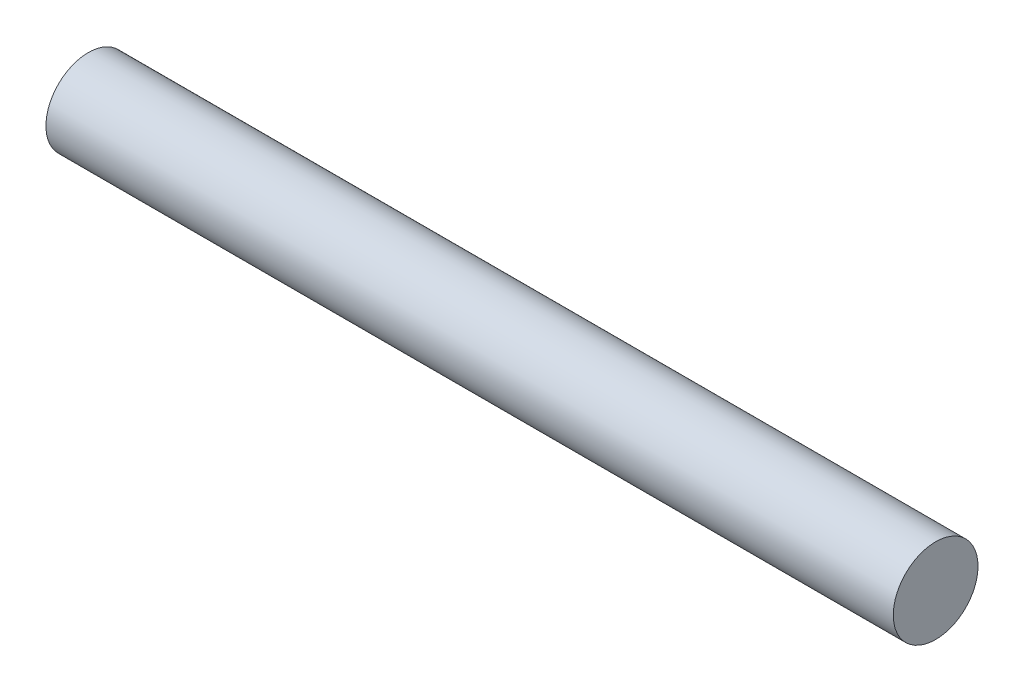
ISO-10303-21;
HEADER;
FILE_DESCRIPTION(('STEP AP214'),'2;1');
FILE_NAME('part.step','',(''),(''),'','','');
FILE_SCHEMA(('AUTOMOTIVE_DESIGN { 1 0 10303 214 1 1 1 1 }'));
ENDSEC;
DATA;
#1=APPLICATION_CONTEXT('core data for automotive mechanical design processes');
#2=APPLICATION_PROTOCOL_DEFINITION('international standard','automotive_design',2000,#1);
#3=PRODUCT_CONTEXT('',#1,'mechanical');
#4=PRODUCT('Part','Part','',(#3));
#5=PRODUCT_RELATED_PRODUCT_CATEGORY('part','',(#4));
#6=PRODUCT_DEFINITION_FORMATION('','',#4);
#7=PRODUCT_DEFINITION_CONTEXT('part definition',#1,'design');
#8=PRODUCT_DEFINITION('design','',#6,#7);
#9=PRODUCT_DEFINITION_SHAPE('','',#8);
#10=(LENGTH_UNIT() NAMED_UNIT(*) SI_UNIT(.MILLI.,.METRE.));
#11=(NAMED_UNIT(*) PLANE_ANGLE_UNIT() SI_UNIT($,.RADIAN.));
#12=(NAMED_UNIT(*) SI_UNIT($,.STERADIAN.) SOLID_ANGLE_UNIT());
#13=UNCERTAINTY_MEASURE_WITH_UNIT(LENGTH_MEASURE(1.E-05),#10,'distance_accuracy_value','');
#14=(GEOMETRIC_REPRESENTATION_CONTEXT(3) GLOBAL_UNCERTAINTY_ASSIGNED_CONTEXT((#13)) GLOBAL_UNIT_ASSIGNED_CONTEXT((#10,
#11,#12)) REPRESENTATION_CONTEXT('',''));
#15=CARTESIAN_POINT('',(0.,0.,0.));
#16=DIRECTION('',(0.,0.,1.));
#17=DIRECTION('',(1.,0.,0.));
#18=AXIS2_PLACEMENT_3D('',#15,#16,#17);
#19=CARTESIAN_POINT('',(80.,0.,0.));
#20=DIRECTION('',(-1.,0.,0.));
#21=DIRECTION('',(0.,0.,1.));
#22=AXIS2_PLACEMENT_3D('',#19,#20,#21);
#23=CYLINDRICAL_SURFACE('',#22,4.);
#24=CARTESIAN_POINT('',(80.,0.,0.));
#25=DIRECTION('',(1.,0.,0.));
#26=DIRECTION('',(0.,0.,-1.));
#27=AXIS2_PLACEMENT_3D('',#24,#25,#26);
#28=CIRCLE('',#27,4.);
#29=CARTESIAN_POINT('',(80.,0.,-4.));
#30=VERTEX_POINT('',#29);
#31=EDGE_CURVE('E10',#30,#30,#28,.T.);
#32=ORIENTED_EDGE('',*,*,#31,.F.);
#33=EDGE_LOOP('',(#32));
#34=FACE_BOUND('',#33,.T.);
#35=CARTESIAN_POINT('',(0.,0.,0.));
#36=DIRECTION('',(1.,0.,0.));
#37=DIRECTION('',(0.,0.,-1.));
#38=AXIS2_PLACEMENT_3D('',#35,#36,#37);
#39=CIRCLE('',#38,4.);
#40=CARTESIAN_POINT('',(0.,0.,-4.));
#41=VERTEX_POINT('',#40);
#42=EDGE_CURVE('E36',#41,#41,#39,.T.);
#43=ORIENTED_EDGE('',*,*,#42,.T.);
#44=EDGE_LOOP('',(#43));
#45=FACE_BOUND('',#44,.T.);
#46=ADVANCED_FACE('F33',(#34,#45),#23,.T.);
#47=CARTESIAN_POINT('',(80.,0.,0.));
#48=DIRECTION('',(1.,0.,0.));
#49=DIRECTION('',(0.,0.,-1.));
#50=AXIS2_PLACEMENT_3D('',#47,#48,#49);
#51=PLANE('',#50);
#52=ORIENTED_EDGE('',*,*,#31,.T.);
#53=EDGE_LOOP('',(#52));
#54=FACE_BOUND('',#53,.T.);
#55=ADVANCED_FACE('F48',(#54),#51,.T.);
#56=CARTESIAN_POINT('',(0.,0.,0.));
#57=DIRECTION('',(1.,0.,0.));
#58=DIRECTION('',(0.,0.,-1.));
#59=AXIS2_PLACEMENT_3D('',#56,#57,#58);
#60=PLANE('',#59);
#61=ORIENTED_EDGE('',*,*,#42,.F.);
#62=EDGE_LOOP('',(#61));
#63=FACE_BOUND('',#62,.T.);
#64=ADVANCED_FACE('F46',(#63),#60,.F.);
#65=CLOSED_SHELL('',(#46,#55,#64));
#66=MANIFOLD_SOLID_BREP('B2',#65);
#67=ADVANCED_BREP_SHAPE_REPRESENTATION('',(#18,#66),#14);
#68=SHAPE_DEFINITION_REPRESENTATION(#9,#67);
ENDSEC;
END-ISO-10303-21;
